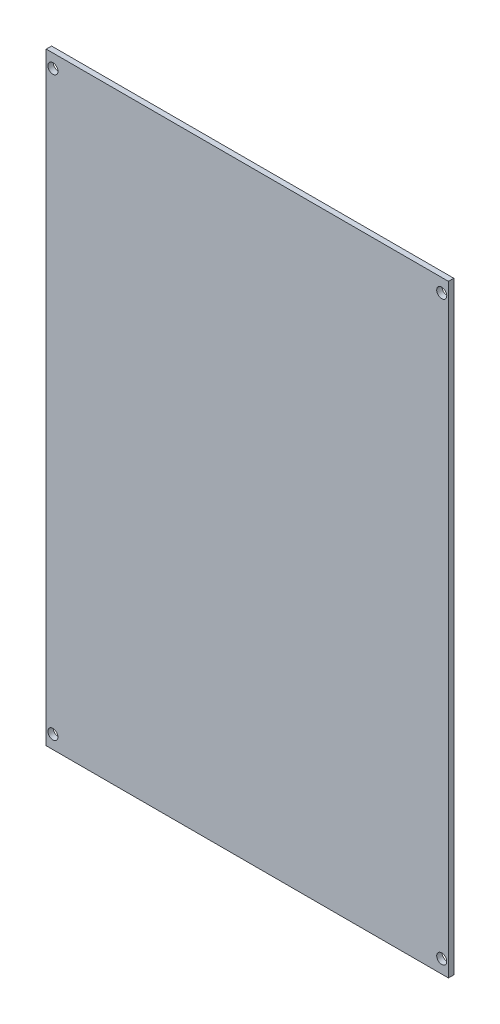
ISO-10303-21;
HEADER;
FILE_DESCRIPTION(('STEP AP214'),'2;1');
FILE_NAME('part.step','',(''),(''),'','','');
FILE_SCHEMA(('AUTOMOTIVE_DESIGN { 1 0 10303 214 1 1 1 1 }'));
ENDSEC;
DATA;
#1=APPLICATION_CONTEXT('core data for automotive mechanical design processes');
#2=APPLICATION_PROTOCOL_DEFINITION('international standard','automotive_design',2000,#1);
#3=PRODUCT_CONTEXT('',#1,'mechanical');
#4=PRODUCT('Part','Part','',(#3));
#5=PRODUCT_RELATED_PRODUCT_CATEGORY('part','',(#4));
#6=PRODUCT_DEFINITION_FORMATION('','',#4);
#7=PRODUCT_DEFINITION_CONTEXT('part definition',#1,'design');
#8=PRODUCT_DEFINITION('design','',#6,#7);
#9=PRODUCT_DEFINITION_SHAPE('','',#8);
#10=(LENGTH_UNIT() NAMED_UNIT(*) SI_UNIT(.MILLI.,.METRE.));
#11=(NAMED_UNIT(*) PLANE_ANGLE_UNIT() SI_UNIT($,.RADIAN.));
#12=(NAMED_UNIT(*) SI_UNIT($,.STERADIAN.) SOLID_ANGLE_UNIT());
#13=UNCERTAINTY_MEASURE_WITH_UNIT(LENGTH_MEASURE(1.E-05),#10,'distance_accuracy_value','');
#14=(GEOMETRIC_REPRESENTATION_CONTEXT(3) GLOBAL_UNCERTAINTY_ASSIGNED_CONTEXT((#13)) GLOBAL_UNIT_ASSIGNED_CONTEXT((#10,
#11,#12)) REPRESENTATION_CONTEXT('',''));
#15=CARTESIAN_POINT('',(0.,0.,0.));
#16=DIRECTION('',(0.,0.,1.));
#17=DIRECTION('',(1.,0.,0.));
#18=AXIS2_PLACEMENT_3D('',#15,#16,#17);
#19=CARTESIAN_POINT('',(-60.,-90.,1.6));
#20=DIRECTION('',(1.,0.,0.));
#21=DIRECTION('',(0.,0.,-1.));
#22=AXIS2_PLACEMENT_3D('',#19,#20,#21);
#23=PLANE('',#22);
#24=DIRECTION('',(0.,-1.,0.));
#25=VECTOR('',#24,1.);
#26=CARTESIAN_POINT('',(-60.,-90.,0.));
#27=LINE('',#26,#25);
#28=CARTESIAN_POINT('',(-60.,90.,0.));
#29=VERTEX_POINT('',#28);
#30=CARTESIAN_POINT('',(-60.,-90.,0.));
#31=VERTEX_POINT('',#30);
#32=EDGE_CURVE('E110',#29,#31,#27,.T.);
#33=ORIENTED_EDGE('',*,*,#32,.T.);
#34=DIRECTION('',(0.,0.,-1.));
#35=VECTOR('',#34,1.);
#36=CARTESIAN_POINT('',(-60.,-90.,1.6));
#37=LINE('',#36,#35);
#38=CARTESIAN_POINT('',(-60.,-90.,1.6));
#39=VERTEX_POINT('',#38);
#40=EDGE_CURVE('E11',#39,#31,#37,.T.);
#41=ORIENTED_EDGE('',*,*,#40,.F.);
#42=DIRECTION('',(0.,-1.,0.));
#43=VECTOR('',#42,1.);
#44=CARTESIAN_POINT('',(-60.,-90.,1.6));
#45=LINE('',#44,#43);
#46=CARTESIAN_POINT('',(-60.,90.,1.6));
#47=VERTEX_POINT('',#46);
#48=EDGE_CURVE('E93',#47,#39,#45,.T.);
#49=ORIENTED_EDGE('',*,*,#48,.F.);
#50=DIRECTION('',(0.,0.,-1.));
#51=VECTOR('',#50,1.);
#52=CARTESIAN_POINT('',(-60.,90.,1.6));
#53=LINE('',#52,#51);
#54=EDGE_CURVE('E106',#47,#29,#53,.T.);
#55=ORIENTED_EDGE('',*,*,#54,.T.);
#56=EDGE_LOOP('',(#33,#41,#49,#55));
#57=FACE_BOUND('',#56,.T.);
#58=ADVANCED_FACE('F39',(#57),#23,.F.);
#59=CARTESIAN_POINT('',(60.,-90.,1.6));
#60=DIRECTION('',(0.,1.,0.));
#61=DIRECTION('',(-1.,0.,0.));
#62=AXIS2_PLACEMENT_3D('',#59,#60,#61);
#63=PLANE('',#62);
#64=DIRECTION('',(1.,0.,0.));
#65=VECTOR('',#64,1.);
#66=CARTESIAN_POINT('',(60.,-90.,0.));
#67=LINE('',#66,#65);
#68=CARTESIAN_POINT('',(60.,-90.,0.));
#69=VERTEX_POINT('',#68);
#70=EDGE_CURVE('E98',#31,#69,#67,.T.);
#71=ORIENTED_EDGE('',*,*,#70,.T.);
#72=DIRECTION('',(0.,0.,-1.));
#73=VECTOR('',#72,1.);
#74=CARTESIAN_POINT('',(60.,-90.,1.6));
#75=LINE('',#74,#73);
#76=CARTESIAN_POINT('',(60.,-90.,1.6));
#77=VERTEX_POINT('',#76);
#78=EDGE_CURVE('E49',#77,#69,#75,.T.);
#79=ORIENTED_EDGE('',*,*,#78,.F.);
#80=DIRECTION('',(1.,0.,0.));
#81=VECTOR('',#80,1.);
#82=CARTESIAN_POINT('',(60.,-90.,1.6));
#83=LINE('',#82,#81);
#84=EDGE_CURVE('E88',#39,#77,#83,.T.);
#85=ORIENTED_EDGE('',*,*,#84,.F.);
#86=ORIENTED_EDGE('',*,*,#40,.T.);
#87=EDGE_LOOP('',(#71,#79,#85,#86));
#88=FACE_BOUND('',#87,.T.);
#89=ADVANCED_FACE('F97',(#88),#63,.F.);
#90=CARTESIAN_POINT('',(60.,-90.,1.6));
#91=DIRECTION('',(-1.,0.,0.));
#92=DIRECTION('',(0.,0.,1.));
#93=AXIS2_PLACEMENT_3D('',#90,#91,#92);
#94=PLANE('',#93);
#95=DIRECTION('',(0.,1.,0.));
#96=VECTOR('',#95,1.);
#97=CARTESIAN_POINT('',(60.,-90.,0.));
#98=LINE('',#97,#96);
#99=CARTESIAN_POINT('',(60.,90.,0.));
#100=VERTEX_POINT('',#99);
#101=EDGE_CURVE('E75',#69,#100,#98,.T.);
#102=ORIENTED_EDGE('',*,*,#101,.T.);
#103=DIRECTION('',(0.,0.,-1.));
#104=VECTOR('',#103,1.);
#105=CARTESIAN_POINT('',(60.,90.,1.6));
#106=LINE('',#105,#104);
#107=CARTESIAN_POINT('',(60.,90.,1.6));
#108=VERTEX_POINT('',#107);
#109=EDGE_CURVE('E100',#108,#100,#106,.T.);
#110=ORIENTED_EDGE('',*,*,#109,.F.);
#111=DIRECTION('',(0.,1.,0.));
#112=VECTOR('',#111,1.);
#113=CARTESIAN_POINT('',(60.,-90.,1.6));
#114=LINE('',#113,#112);
#115=EDGE_CURVE('E91',#77,#108,#114,.T.);
#116=ORIENTED_EDGE('',*,*,#115,.F.);
#117=ORIENTED_EDGE('',*,*,#78,.T.);
#118=EDGE_LOOP('',(#102,#110,#116,#117));
#119=FACE_BOUND('',#118,.T.);
#120=ADVANCED_FACE('F102',(#119),#94,.F.);
#121=CARTESIAN_POINT('',(60.,90.,1.6));
#122=DIRECTION('',(0.,-1.,0.));
#123=DIRECTION('',(1.,0.,0.));
#124=AXIS2_PLACEMENT_3D('',#121,#122,#123);
#125=PLANE('',#124);
#126=DIRECTION('',(-1.,0.,0.));
#127=VECTOR('',#126,1.);
#128=CARTESIAN_POINT('',(60.,90.,0.));
#129=LINE('',#128,#127);
#130=EDGE_CURVE('E81',#100,#29,#129,.T.);
#131=ORIENTED_EDGE('',*,*,#130,.T.);
#132=ORIENTED_EDGE('',*,*,#54,.F.);
#133=DIRECTION('',(-1.,0.,0.));
#134=VECTOR('',#133,1.);
#135=CARTESIAN_POINT('',(60.,90.,1.6));
#136=LINE('',#135,#134);
#137=EDGE_CURVE('E58',#108,#47,#136,.T.);
#138=ORIENTED_EDGE('',*,*,#137,.F.);
#139=ORIENTED_EDGE('',*,*,#109,.T.);
#140=EDGE_LOOP('',(#131,#132,#138,#139));
#141=FACE_BOUND('',#140,.T.);
#142=ADVANCED_FACE('F155',(#141),#125,.F.);
#143=CARTESIAN_POINT('',(0.,0.,1.6));
#144=DIRECTION('',(0.,0.,1.));
#145=DIRECTION('',(1.,0.,0.));
#146=AXIS2_PLACEMENT_3D('',#143,#144,#145);
#147=PLANE('',#146);
#148=CARTESIAN_POINT('',(-58.,-86.,1.6));
#149=DIRECTION('',(0.,0.,1.));
#150=DIRECTION('',(1.,0.,0.));
#151=AXIS2_PLACEMENT_3D('',#148,#149,#150);
#152=CIRCLE('',#151,1.5);
#153=CARTESIAN_POINT('',(-56.5,-86.,1.6));
#154=VERTEX_POINT('',#153);
#155=EDGE_CURVE('E235',#154,#154,#152,.T.);
#156=ORIENTED_EDGE('',*,*,#155,.F.);
#157=EDGE_LOOP('',(#156));
#158=FACE_BOUND('',#157,.T.);
#159=CARTESIAN_POINT('',(58.,-86.,1.6));
#160=DIRECTION('',(0.,0.,1.));
#161=DIRECTION('',(1.,0.,0.));
#162=AXIS2_PLACEMENT_3D('',#159,#160,#161);
#163=CIRCLE('',#162,1.5);
#164=CARTESIAN_POINT('',(59.5,-86.,1.6));
#165=VERTEX_POINT('',#164);
#166=EDGE_CURVE('E237',#165,#165,#163,.T.);
#167=ORIENTED_EDGE('',*,*,#166,.F.);
#168=EDGE_LOOP('',(#167));
#169=FACE_BOUND('',#168,.T.);
#170=CARTESIAN_POINT('',(58.,86.,1.6));
#171=DIRECTION('',(0.,0.,1.));
#172=DIRECTION('',(1.,0.,0.));
#173=AXIS2_PLACEMENT_3D('',#170,#171,#172);
#174=CIRCLE('',#173,1.5);
#175=CARTESIAN_POINT('',(59.5,86.,1.6));
#176=VERTEX_POINT('',#175);
#177=EDGE_CURVE('E241',#176,#176,#174,.T.);
#178=ORIENTED_EDGE('',*,*,#177,.F.);
#179=EDGE_LOOP('',(#178));
#180=FACE_BOUND('',#179,.T.);
#181=CARTESIAN_POINT('',(-58.,86.,1.6));
#182=DIRECTION('',(0.,0.,1.));
#183=DIRECTION('',(1.,0.,0.));
#184=AXIS2_PLACEMENT_3D('',#181,#182,#183);
#185=CIRCLE('',#184,1.5);
#186=CARTESIAN_POINT('',(-56.5,86.,1.6));
#187=VERTEX_POINT('',#186);
#188=EDGE_CURVE('E129',#187,#187,#185,.T.);
#189=ORIENTED_EDGE('',*,*,#188,.F.);
#190=EDGE_LOOP('',(#189));
#191=FACE_BOUND('',#190,.T.);
#192=ORIENTED_EDGE('',*,*,#48,.T.);
#193=ORIENTED_EDGE('',*,*,#84,.T.);
#194=ORIENTED_EDGE('',*,*,#115,.T.);
#195=ORIENTED_EDGE('',*,*,#137,.T.);
#196=EDGE_LOOP('',(#192,#193,#194,#195));
#197=FACE_BOUND('',#196,.T.);
#198=ADVANCED_FACE('F89',(#158,#169,#180,#191,#197),#147,.T.);
#199=CARTESIAN_POINT('',(0.,0.,0.));
#200=DIRECTION('',(0.,0.,1.));
#201=DIRECTION('',(1.,0.,0.));
#202=AXIS2_PLACEMENT_3D('',#199,#200,#201);
#203=PLANE('',#202);
#204=CARTESIAN_POINT('',(-58.,-86.,0.));
#205=DIRECTION('',(0.,0.,1.));
#206=DIRECTION('',(1.,0.,0.));
#207=AXIS2_PLACEMENT_3D('',#204,#205,#206);
#208=CIRCLE('',#207,1.5);
#209=CARTESIAN_POINT('',(-56.5,-86.,0.));
#210=VERTEX_POINT('',#209);
#211=EDGE_CURVE('E42',#210,#210,#208,.F.);
#212=ORIENTED_EDGE('',*,*,#211,.F.);
#213=EDGE_LOOP('',(#212));
#214=FACE_BOUND('',#213,.T.);
#215=CARTESIAN_POINT('',(58.,-86.,0.));
#216=DIRECTION('',(0.,0.,1.));
#217=DIRECTION('',(1.,0.,0.));
#218=AXIS2_PLACEMENT_3D('',#215,#216,#217);
#219=CIRCLE('',#218,1.5);
#220=CARTESIAN_POINT('',(59.5,-86.,0.));
#221=VERTEX_POINT('',#220);
#222=EDGE_CURVE('E132',#221,#221,#219,.F.);
#223=ORIENTED_EDGE('',*,*,#222,.F.);
#224=EDGE_LOOP('',(#223));
#225=FACE_BOUND('',#224,.T.);
#226=CARTESIAN_POINT('',(58.,86.,0.));
#227=DIRECTION('',(0.,0.,1.));
#228=DIRECTION('',(1.,0.,0.));
#229=AXIS2_PLACEMENT_3D('',#226,#227,#228);
#230=CIRCLE('',#229,1.5);
#231=CARTESIAN_POINT('',(59.5,86.,0.));
#232=VERTEX_POINT('',#231);
#233=EDGE_CURVE('E128',#232,#232,#230,.F.);
#234=ORIENTED_EDGE('',*,*,#233,.F.);
#235=EDGE_LOOP('',(#234));
#236=FACE_BOUND('',#235,.T.);
#237=CARTESIAN_POINT('',(-58.,86.,0.));
#238=DIRECTION('',(0.,0.,1.));
#239=DIRECTION('',(1.,0.,0.));
#240=AXIS2_PLACEMENT_3D('',#237,#238,#239);
#241=CIRCLE('',#240,1.5);
#242=CARTESIAN_POINT('',(-56.5,86.,0.));
#243=VERTEX_POINT('',#242);
#244=EDGE_CURVE('E124',#243,#243,#241,.F.);
#245=ORIENTED_EDGE('',*,*,#244,.F.);
#246=EDGE_LOOP('',(#245));
#247=FACE_BOUND('',#246,.T.);
#248=ORIENTED_EDGE('',*,*,#32,.F.);
#249=ORIENTED_EDGE('',*,*,#130,.F.);
#250=ORIENTED_EDGE('',*,*,#101,.F.);
#251=ORIENTED_EDGE('',*,*,#70,.F.);
#252=EDGE_LOOP('',(#248,#249,#250,#251));
#253=FACE_BOUND('',#252,.T.);
#254=ADVANCED_FACE('F143',(#214,#225,#236,#247,#253),#203,.F.);
#255=CARTESIAN_POINT('',(-58.,86.,1.6));
#256=DIRECTION('',(0.,0.,-1.));
#257=DIRECTION('',(-1.,0.,0.));
#258=AXIS2_PLACEMENT_3D('',#255,#256,#257);
#259=CYLINDRICAL_SURFACE('',#258,1.5);
#260=ORIENTED_EDGE('',*,*,#188,.T.);
#261=EDGE_LOOP('',(#260));
#262=FACE_BOUND('',#261,.T.);
#263=ORIENTED_EDGE('',*,*,#244,.T.);
#264=EDGE_LOOP('',(#263));
#265=FACE_BOUND('',#264,.T.);
#266=ADVANCED_FACE('F146',(#262,#265),#259,.F.);
#267=CARTESIAN_POINT('',(58.,86.,1.6));
#268=DIRECTION('',(0.,0.,-1.));
#269=DIRECTION('',(-1.,0.,0.));
#270=AXIS2_PLACEMENT_3D('',#267,#268,#269);
#271=CYLINDRICAL_SURFACE('',#270,1.5);
#272=ORIENTED_EDGE('',*,*,#177,.T.);
#273=EDGE_LOOP('',(#272));
#274=FACE_BOUND('',#273,.T.);
#275=ORIENTED_EDGE('',*,*,#233,.T.);
#276=EDGE_LOOP('',(#275));
#277=FACE_BOUND('',#276,.T.);
#278=ADVANCED_FACE('F200',(#274,#277),#271,.F.);
#279=CARTESIAN_POINT('',(58.,-86.,1.6));
#280=DIRECTION('',(0.,0.,-1.));
#281=DIRECTION('',(-1.,0.,0.));
#282=AXIS2_PLACEMENT_3D('',#279,#280,#281);
#283=CYLINDRICAL_SURFACE('',#282,1.5);
#284=ORIENTED_EDGE('',*,*,#166,.T.);
#285=EDGE_LOOP('',(#284));
#286=FACE_BOUND('',#285,.T.);
#287=ORIENTED_EDGE('',*,*,#222,.T.);
#288=EDGE_LOOP('',(#287));
#289=FACE_BOUND('',#288,.T.);
#290=ADVANCED_FACE('F210',(#286,#289),#283,.F.);
#291=CARTESIAN_POINT('',(-58.,-86.,1.6));
#292=DIRECTION('',(0.,0.,-1.));
#293=DIRECTION('',(-1.,0.,0.));
#294=AXIS2_PLACEMENT_3D('',#291,#292,#293);
#295=CYLINDRICAL_SURFACE('',#294,1.5);
#296=ORIENTED_EDGE('',*,*,#155,.T.);
#297=EDGE_LOOP('',(#296));
#298=FACE_BOUND('',#297,.T.);
#299=ORIENTED_EDGE('',*,*,#211,.T.);
#300=EDGE_LOOP('',(#299));
#301=FACE_BOUND('',#300,.T.);
#302=ADVANCED_FACE('F141',(#298,#301),#295,.F.);
#303=CLOSED_SHELL('',(#58,#89,#120,#142,#198,#254,#266,#278,#290,#302));
#304=MANIFOLD_SOLID_BREP('B2',#303);
#305=ADVANCED_BREP_SHAPE_REPRESENTATION('',(#18,#304),#14);
#306=SHAPE_DEFINITION_REPRESENTATION(#9,#305);
ENDSEC;
END-ISO-10303-21;
